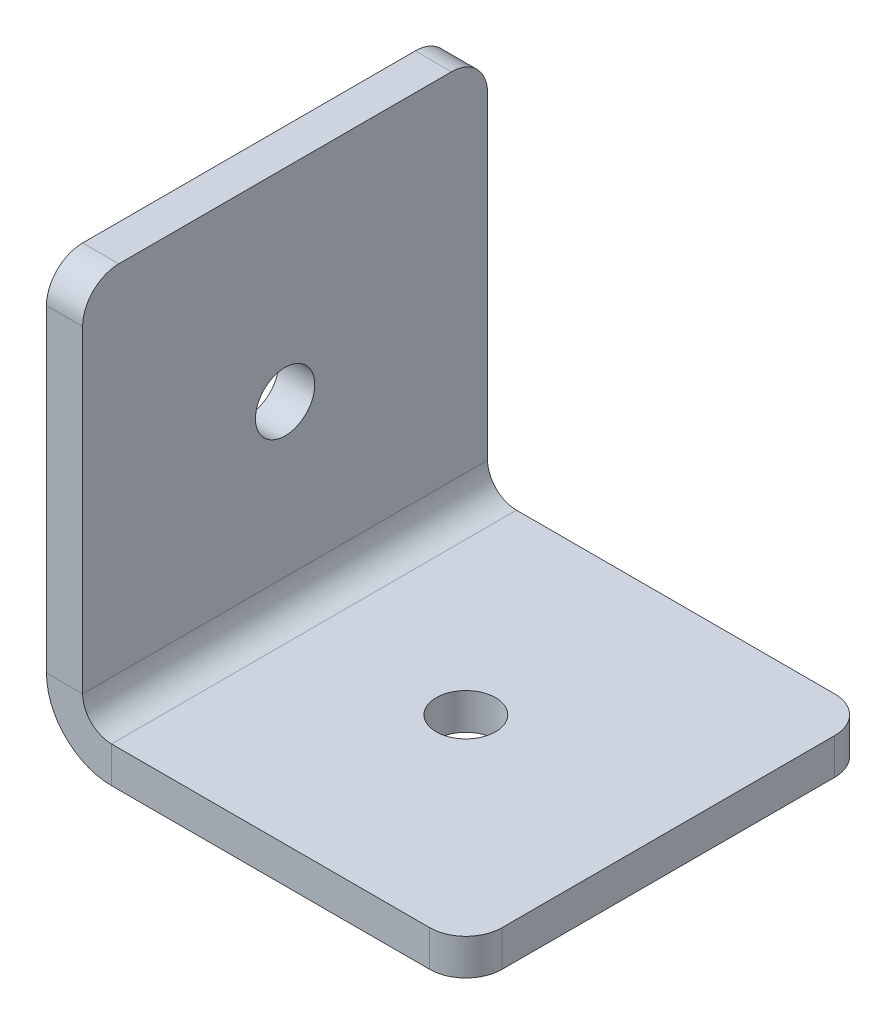
ISO-10303-21;
HEADER;
FILE_DESCRIPTION(('STEP AP214'),'2;1');
FILE_NAME('part.step','',(''),(''),'','','');
FILE_SCHEMA(('AUTOMOTIVE_DESIGN { 1 0 10303 214 1 1 1 1 }'));
ENDSEC;
DATA;
#1=APPLICATION_CONTEXT('core data for automotive mechanical design processes');
#2=APPLICATION_PROTOCOL_DEFINITION('international standard','automotive_design',2000,#1);
#3=PRODUCT_CONTEXT('',#1,'mechanical');
#4=PRODUCT('Part','Part','',(#3));
#5=PRODUCT_RELATED_PRODUCT_CATEGORY('part','',(#4));
#6=PRODUCT_DEFINITION_FORMATION('','',#4);
#7=PRODUCT_DEFINITION_CONTEXT('part definition',#1,'design');
#8=PRODUCT_DEFINITION('design','',#6,#7);
#9=PRODUCT_DEFINITION_SHAPE('','',#8);
#10=(LENGTH_UNIT() NAMED_UNIT(*) SI_UNIT(.MILLI.,.METRE.));
#11=(NAMED_UNIT(*) PLANE_ANGLE_UNIT() SI_UNIT($,.RADIAN.));
#12=(NAMED_UNIT(*) SI_UNIT($,.STERADIAN.) SOLID_ANGLE_UNIT());
#13=UNCERTAINTY_MEASURE_WITH_UNIT(LENGTH_MEASURE(1.E-05),#10,'distance_accuracy_value','');
#14=(GEOMETRIC_REPRESENTATION_CONTEXT(3) GLOBAL_UNCERTAINTY_ASSIGNED_CONTEXT((#13)) GLOBAL_UNIT_ASSIGNED_CONTEXT((#10,
#11,#12)) REPRESENTATION_CONTEXT('',''));
#15=CARTESIAN_POINT('',(0.,0.,0.));
#16=DIRECTION('',(0.,0.,1.));
#17=DIRECTION('',(1.,0.,0.));
#18=AXIS2_PLACEMENT_3D('',#15,#16,#17);
#19=CARTESIAN_POINT('',(5.,0.,0.));
#20=DIRECTION('',(0.,0.,-1.));
#21=DIRECTION('',(0.,1.,0.));
#22=AXIS2_PLACEMENT_3D('',#19,#20,#21);
#23=PLANE('',#22);
#24=DIRECTION('',(0.,1.,0.));
#25=VECTOR('',#24,1.);
#26=CARTESIAN_POINT('',(0.,0.,0.));
#27=LINE('',#26,#25);
#28=CARTESIAN_POINT('',(0.,53.,0.));
#29=VERTEX_POINT('',#28);
#30=CARTESIAN_POINT('',(0.,9.,0.));
#31=VERTEX_POINT('',#30);
#32=EDGE_CURVE('E178',#29,#31,#27,.F.);
#33=ORIENTED_EDGE('',*,*,#32,.F.);
#34=DIRECTION('',(-1.,0.,0.));
#35=VECTOR('',#34,1.);
#36=CARTESIAN_POINT('',(5.,53.,0.));
#37=LINE('',#36,#35);
#38=CARTESIAN_POINT('',(5.,53.,0.));
#39=VERTEX_POINT('',#38);
#40=EDGE_CURVE('E113',#29,#39,#37,.F.);
#41=ORIENTED_EDGE('',*,*,#40,.T.);
#42=DIRECTION('',(0.,1.,0.));
#43=VECTOR('',#42,1.);
#44=CARTESIAN_POINT('',(5.,0.,0.));
#45=LINE('',#44,#43);
#46=CARTESIAN_POINT('',(5.,9.,0.));
#47=VERTEX_POINT('',#46);
#48=EDGE_CURVE('E107',#39,#47,#45,.F.);
#49=ORIENTED_EDGE('',*,*,#48,.T.);
#50=DIRECTION('',(1.,0.,0.));
#51=VECTOR('',#50,1.);
#52=CARTESIAN_POINT('',(5.,9.,0.));
#53=LINE('',#52,#51);
#54=EDGE_CURVE('E110',#31,#47,#53,.T.);
#55=ORIENTED_EDGE('',*,*,#54,.F.);
#56=EDGE_LOOP('',(#33,#41,#49,#55));
#57=FACE_BOUND('',#56,.T.);
#58=ADVANCED_FACE('F16',(#57),#23,.T.);
#59=CARTESIAN_POINT('',(5.,58.,56.));
#60=DIRECTION('',(0.,-1.,0.));
#61=DIRECTION('',(0.,0.,-1.));
#62=AXIS2_PLACEMENT_3D('',#59,#60,#61);
#63=PLANE('',#62);
#64=DIRECTION('',(0.,0.,-1.));
#65=VECTOR('',#64,1.);
#66=CARTESIAN_POINT('',(5.,58.,56.));
#67=LINE('',#66,#65);
#68=CARTESIAN_POINT('',(5.,58.,51.));
#69=VERTEX_POINT('',#68);
#70=CARTESIAN_POINT('',(5.,58.,5.));
#71=VERTEX_POINT('',#70);
#72=EDGE_CURVE('E116',#69,#71,#67,.T.);
#73=ORIENTED_EDGE('',*,*,#72,.T.);
#74=DIRECTION('',(1.,0.,0.));
#75=VECTOR('',#74,1.);
#76=CARTESIAN_POINT('',(5.,58.,5.));
#77=LINE('',#76,#75);
#78=CARTESIAN_POINT('',(0.,58.,5.));
#79=VERTEX_POINT('',#78);
#80=EDGE_CURVE('E37',#71,#79,#77,.F.);
#81=ORIENTED_EDGE('',*,*,#80,.T.);
#82=DIRECTION('',(0.,0.,-1.));
#83=VECTOR('',#82,1.);
#84=CARTESIAN_POINT('',(0.,58.,56.));
#85=LINE('',#84,#83);
#86=CARTESIAN_POINT('',(0.,58.,51.));
#87=VERTEX_POINT('',#86);
#88=EDGE_CURVE('E176',#87,#79,#85,.T.);
#89=ORIENTED_EDGE('',*,*,#88,.F.);
#90=DIRECTION('',(-1.,0.,0.));
#91=VECTOR('',#90,1.);
#92=CARTESIAN_POINT('',(5.,58.,51.));
#93=LINE('',#92,#91);
#94=EDGE_CURVE('E209',#87,#69,#93,.F.);
#95=ORIENTED_EDGE('',*,*,#94,.T.);
#96=EDGE_LOOP('',(#73,#81,#89,#95));
#97=FACE_BOUND('',#96,.T.);
#98=ADVANCED_FACE('F221',(#97),#63,.F.);
#99=CARTESIAN_POINT('',(5.,0.,56.));
#100=DIRECTION('',(0.,0.,-1.));
#101=DIRECTION('',(0.,1.,0.));
#102=AXIS2_PLACEMENT_3D('',#99,#100,#101);
#103=PLANE('',#102);
#104=DIRECTION('',(0.,1.,0.));
#105=VECTOR('',#104,1.);
#106=CARTESIAN_POINT('',(5.,0.,56.));
#107=LINE('',#106,#105);
#108=CARTESIAN_POINT('',(5.,53.,56.));
#109=VERTEX_POINT('',#108);
#110=CARTESIAN_POINT('',(5.,9.,56.));
#111=VERTEX_POINT('',#110);
#112=EDGE_CURVE('E142',#109,#111,#107,.F.);
#113=ORIENTED_EDGE('',*,*,#112,.F.);
#114=DIRECTION('',(-1.,0.,0.));
#115=VECTOR('',#114,1.);
#116=CARTESIAN_POINT('',(5.,53.,56.));
#117=LINE('',#116,#115);
#118=CARTESIAN_POINT('',(0.,53.,56.));
#119=VERTEX_POINT('',#118);
#120=EDGE_CURVE('E10',#109,#119,#117,.T.);
#121=ORIENTED_EDGE('',*,*,#120,.T.);
#122=DIRECTION('',(0.,1.,0.));
#123=VECTOR('',#122,1.);
#124=CARTESIAN_POINT('',(0.,0.,56.));
#125=LINE('',#124,#123);
#126=CARTESIAN_POINT('',(0.,9.,56.));
#127=VERTEX_POINT('',#126);
#128=EDGE_CURVE('E163',#119,#127,#125,.F.);
#129=ORIENTED_EDGE('',*,*,#128,.T.);
#130=DIRECTION('',(1.,0.,0.));
#131=VECTOR('',#130,1.);
#132=CARTESIAN_POINT('',(5.,9.,56.));
#133=LINE('',#132,#131);
#134=EDGE_CURVE('E129',#127,#111,#133,.T.);
#135=ORIENTED_EDGE('',*,*,#134,.T.);
#136=EDGE_LOOP('',(#113,#121,#129,#135));
#137=FACE_BOUND('',#136,.T.);
#138=ADVANCED_FACE('F266',(#137),#103,.F.);
#139=CARTESIAN_POINT('',(9.,9.,56.));
#140=DIRECTION('',(0.,0.,-1.));
#141=DIRECTION('',(-1.,0.,0.));
#142=AXIS2_PLACEMENT_3D('',#139,#140,#141);
#143=PLANE('',#142);
#144=ORIENTED_EDGE('',*,*,#134,.F.);
#145=CARTESIAN_POINT('',(9.,9.,56.));
#146=DIRECTION('',(0.,0.,1.));
#147=DIRECTION('',(1.,0.,0.));
#148=AXIS2_PLACEMENT_3D('',#145,#146,#147);
#149=CIRCLE('',#148,9.);
#150=CARTESIAN_POINT('',(9.,0.,56.));
#151=VERTEX_POINT('',#150);
#152=EDGE_CURVE('E171',#127,#151,#149,.T.);
#153=ORIENTED_EDGE('',*,*,#152,.T.);
#154=DIRECTION('',(0.,1.,0.));
#155=VECTOR('',#154,1.);
#156=CARTESIAN_POINT('',(9.,5.,56.));
#157=LINE('',#156,#155);
#158=CARTESIAN_POINT('',(9.,5.,56.));
#159=VERTEX_POINT('',#158);
#160=EDGE_CURVE('E183',#151,#159,#157,.T.);
#161=ORIENTED_EDGE('',*,*,#160,.T.);
#162=CARTESIAN_POINT('',(9.,9.,56.));
#163=DIRECTION('',(0.,0.,1.));
#164=DIRECTION('',(1.,0.,0.));
#165=AXIS2_PLACEMENT_3D('',#162,#163,#164);
#166=CIRCLE('',#165,4.);
#167=EDGE_CURVE('E138',#111,#159,#166,.T.);
#168=ORIENTED_EDGE('',*,*,#167,.F.);
#169=EDGE_LOOP('',(#144,#153,#161,#168));
#170=FACE_BOUND('',#169,.T.);
#171=ADVANCED_FACE('F269',(#170),#143,.F.);
#172=CARTESIAN_POINT('',(0.,5.,56.));
#173=DIRECTION('',(0.,0.,1.));
#174=DIRECTION('',(1.,0.,0.));
#175=AXIS2_PLACEMENT_3D('',#172,#173,#174);
#176=PLANE('',#175);
#177=DIRECTION('',(1.,0.,0.));
#178=VECTOR('',#177,1.);
#179=CARTESIAN_POINT('',(0.,0.,56.));
#180=LINE('',#179,#178);
#181=CARTESIAN_POINT('',(53.,0.,56.));
#182=VERTEX_POINT('',#181);
#183=EDGE_CURVE('E166',#151,#182,#180,.T.);
#184=ORIENTED_EDGE('',*,*,#183,.T.);
#185=DIRECTION('',(0.,1.,0.));
#186=VECTOR('',#185,1.);
#187=CARTESIAN_POINT('',(53.,5.,56.));
#188=LINE('',#187,#186);
#189=CARTESIAN_POINT('',(53.,5.,56.));
#190=VERTEX_POINT('',#189);
#191=EDGE_CURVE('E128',#182,#190,#188,.T.);
#192=ORIENTED_EDGE('',*,*,#191,.T.);
#193=DIRECTION('',(1.,0.,0.));
#194=VECTOR('',#193,1.);
#195=CARTESIAN_POINT('',(0.,5.,56.));
#196=LINE('',#195,#194);
#197=EDGE_CURVE('E149',#159,#190,#196,.T.);
#198=ORIENTED_EDGE('',*,*,#197,.F.);
#199=ORIENTED_EDGE('',*,*,#160,.F.);
#200=EDGE_LOOP('',(#184,#192,#198,#199));
#201=FACE_BOUND('',#200,.T.);
#202=ADVANCED_FACE('F239',(#201),#176,.T.);
#203=CARTESIAN_POINT('',(58.,5.,56.));
#204=DIRECTION('',(1.,0.,0.));
#205=DIRECTION('',(0.,0.,-1.));
#206=AXIS2_PLACEMENT_3D('',#203,#204,#205);
#207=PLANE('',#206);
#208=DIRECTION('',(0.,0.,-1.));
#209=VECTOR('',#208,1.);
#210=CARTESIAN_POINT('',(58.,5.,56.));
#211=LINE('',#210,#209);
#212=CARTESIAN_POINT('',(58.,5.,51.));
#213=VERTEX_POINT('',#212);
#214=CARTESIAN_POINT('',(58.,5.,5.));
#215=VERTEX_POINT('',#214);
#216=EDGE_CURVE('E144',#213,#215,#211,.T.);
#217=ORIENTED_EDGE('',*,*,#216,.F.);
#218=DIRECTION('',(0.,1.,0.));
#219=VECTOR('',#218,1.);
#220=CARTESIAN_POINT('',(58.,5.,51.));
#221=LINE('',#220,#219);
#222=CARTESIAN_POINT('',(58.,0.,51.));
#223=VERTEX_POINT('',#222);
#224=EDGE_CURVE('E196',#213,#223,#221,.F.);
#225=ORIENTED_EDGE('',*,*,#224,.T.);
#226=DIRECTION('',(0.,0.,1.));
#227=VECTOR('',#226,1.);
#228=CARTESIAN_POINT('',(58.,0.,56.));
#229=LINE('',#228,#227);
#230=CARTESIAN_POINT('',(58.,0.,5.));
#231=VERTEX_POINT('',#230);
#232=EDGE_CURVE('E158',#223,#231,#229,.F.);
#233=ORIENTED_EDGE('',*,*,#232,.T.);
#234=DIRECTION('',(0.,-1.,0.));
#235=VECTOR('',#234,1.);
#236=CARTESIAN_POINT('',(58.,5.,5.));
#237=LINE('',#236,#235);
#238=EDGE_CURVE('E193',#231,#215,#237,.F.);
#239=ORIENTED_EDGE('',*,*,#238,.T.);
#240=EDGE_LOOP('',(#217,#225,#233,#239));
#241=FACE_BOUND('',#240,.T.);
#242=ADVANCED_FACE('F248',(#241),#207,.T.);
#243=CARTESIAN_POINT('',(0.,5.,0.));
#244=DIRECTION('',(0.,0.,1.));
#245=DIRECTION('',(1.,0.,0.));
#246=AXIS2_PLACEMENT_3D('',#243,#244,#245);
#247=PLANE('',#246);
#248=DIRECTION('',(1.,0.,0.));
#249=VECTOR('',#248,1.);
#250=CARTESIAN_POINT('',(0.,5.,0.));
#251=LINE('',#250,#249);
#252=CARTESIAN_POINT('',(9.,5.,0.));
#253=VERTEX_POINT('',#252);
#254=CARTESIAN_POINT('',(53.,5.,0.));
#255=VERTEX_POINT('',#254);
#256=EDGE_CURVE('E230',#253,#255,#251,.T.);
#257=ORIENTED_EDGE('',*,*,#256,.T.);
#258=DIRECTION('',(0.,1.,0.));
#259=VECTOR('',#258,1.);
#260=CARTESIAN_POINT('',(53.,5.,0.));
#261=LINE('',#260,#259);
#262=CARTESIAN_POINT('',(53.,0.,0.));
#263=VERTEX_POINT('',#262);
#264=EDGE_CURVE('E202',#255,#263,#261,.F.);
#265=ORIENTED_EDGE('',*,*,#264,.T.);
#266=DIRECTION('',(1.,0.,0.));
#267=VECTOR('',#266,1.);
#268=CARTESIAN_POINT('',(0.,0.,0.));
#269=LINE('',#268,#267);
#270=CARTESIAN_POINT('',(9.,0.,0.));
#271=VERTEX_POINT('',#270);
#272=EDGE_CURVE('E162',#271,#263,#269,.T.);
#273=ORIENTED_EDGE('',*,*,#272,.F.);
#274=DIRECTION('',(0.,1.,0.));
#275=VECTOR('',#274,1.);
#276=CARTESIAN_POINT('',(9.,5.,0.));
#277=LINE('',#276,#275);
#278=EDGE_CURVE('E146',#271,#253,#277,.T.);
#279=ORIENTED_EDGE('',*,*,#278,.T.);
#280=EDGE_LOOP('',(#257,#265,#273,#279));
#281=FACE_BOUND('',#280,.T.);
#282=ADVANCED_FACE('F259',(#281),#247,.F.);
#283=CARTESIAN_POINT('',(5.00000000000001,30.,28.));
#284=DIRECTION('',(1.,0.,0.));
#285=DIRECTION('',(0.,0.,-1.));
#286=AXIS2_PLACEMENT_3D('',#283,#284,#285);
#287=CYLINDRICAL_SURFACE('',#286,4.1);
#288=CARTESIAN_POINT('',(5.00000000000001,30.,28.));
#289=DIRECTION('',(-1.,0.,0.));
#290=DIRECTION('',(0.,0.,1.));
#291=AXIS2_PLACEMENT_3D('',#288,#289,#290);
#292=CIRCLE('',#291,4.1);
#293=CARTESIAN_POINT('',(5.00000000000001,30.,32.1));
#294=VERTEX_POINT('',#293);
#295=EDGE_CURVE('E117',#294,#294,#292,.T.);
#296=ORIENTED_EDGE('',*,*,#295,.F.);
#297=EDGE_LOOP('',(#296));
#298=FACE_BOUND('',#297,.T.);
#299=CARTESIAN_POINT('',(0.,30.,28.));
#300=DIRECTION('',(-1.,0.,0.));
#301=DIRECTION('',(0.,-1.,0.));
#302=AXIS2_PLACEMENT_3D('',#299,#300,#301);
#303=CIRCLE('',#302,4.1);
#304=CARTESIAN_POINT('',(0.,25.9,28.));
#305=VERTEX_POINT('',#304);
#306=EDGE_CURVE('E174',#305,#305,#303,.T.);
#307=ORIENTED_EDGE('',*,*,#306,.T.);
#308=EDGE_LOOP('',(#307));
#309=FACE_BOUND('',#308,.T.);
#310=ADVANCED_FACE('F289',(#298,#309),#287,.F.);
#311=CARTESIAN_POINT('',(30.,5.,28.));
#312=DIRECTION('',(0.,1.,0.));
#313=DIRECTION('',(0.,0.,1.));
#314=AXIS2_PLACEMENT_3D('',#311,#312,#313);
#315=CYLINDRICAL_SURFACE('',#314,4.1);
#316=CARTESIAN_POINT('',(30.,5.,28.));
#317=DIRECTION('',(0.,1.,0.));
#318=DIRECTION('',(0.,0.,1.));
#319=AXIS2_PLACEMENT_3D('',#316,#317,#318);
#320=CIRCLE('',#319,4.1);
#321=CARTESIAN_POINT('',(30.,5.,32.1));
#322=VERTEX_POINT('',#321);
#323=EDGE_CURVE('E224',#322,#322,#320,.T.);
#324=ORIENTED_EDGE('',*,*,#323,.T.);
#325=EDGE_LOOP('',(#324));
#326=FACE_BOUND('',#325,.T.);
#327=CARTESIAN_POINT('',(30.,0.,28.));
#328=DIRECTION('',(0.,1.,0.));
#329=DIRECTION('',(0.,0.,1.));
#330=AXIS2_PLACEMENT_3D('',#327,#328,#329);
#331=CIRCLE('',#330,4.1);
#332=CARTESIAN_POINT('',(30.,0.,32.1));
#333=VERTEX_POINT('',#332);
#334=EDGE_CURVE('E159',#333,#333,#331,.T.);
#335=ORIENTED_EDGE('',*,*,#334,.F.);
#336=EDGE_LOOP('',(#335));
#337=FACE_BOUND('',#336,.T.);
#338=ADVANCED_FACE('F288',(#326,#337),#315,.F.);
#339=CARTESIAN_POINT('',(9.,9.,0.));
#340=DIRECTION('',(0.,0.,1.));
#341=DIRECTION('',(1.,0.,0.));
#342=AXIS2_PLACEMENT_3D('',#339,#340,#341);
#343=PLANE('',#342);
#344=CARTESIAN_POINT('',(9.,9.,0.));
#345=DIRECTION('',(0.,0.,1.));
#346=DIRECTION('',(1.,0.,0.));
#347=AXIS2_PLACEMENT_3D('',#344,#345,#346);
#348=CIRCLE('',#347,9.);
#349=EDGE_CURVE('E127',#271,#31,#348,.F.);
#350=ORIENTED_EDGE('',*,*,#349,.T.);
#351=ORIENTED_EDGE('',*,*,#54,.T.);
#352=CARTESIAN_POINT('',(9.,9.,0.));
#353=DIRECTION('',(0.,0.,-1.));
#354=DIRECTION('',(-1.,0.,0.));
#355=AXIS2_PLACEMENT_3D('',#352,#353,#354);
#356=CIRCLE('',#355,4.);
#357=EDGE_CURVE('E124',#253,#47,#356,.T.);
#358=ORIENTED_EDGE('',*,*,#357,.F.);
#359=ORIENTED_EDGE('',*,*,#278,.F.);
#360=EDGE_LOOP('',(#350,#351,#358,#359));
#361=FACE_BOUND('',#360,.T.);
#362=ADVANCED_FACE('F123',(#361),#343,.F.);
#363=CARTESIAN_POINT('',(0.,5.,56.));
#364=DIRECTION('',(0.,1.,0.));
#365=DIRECTION('',(0.,0.,1.));
#366=AXIS2_PLACEMENT_3D('',#363,#364,#365);
#367=PLANE('',#366);
#368=ORIENTED_EDGE('',*,*,#323,.F.);
#369=EDGE_LOOP('',(#368));
#370=FACE_BOUND('',#369,.T.);
#371=ORIENTED_EDGE('',*,*,#197,.T.);
#372=CARTESIAN_POINT('',(53.,5.,51.));
#373=DIRECTION('',(0.,1.,0.));
#374=DIRECTION('',(0.,0.,1.));
#375=AXIS2_PLACEMENT_3D('',#372,#373,#374);
#376=CIRCLE('',#375,5.);
#377=EDGE_CURVE('E191',#190,#213,#376,.T.);
#378=ORIENTED_EDGE('',*,*,#377,.T.);
#379=ORIENTED_EDGE('',*,*,#216,.T.);
#380=CARTESIAN_POINT('',(53.,5.,5.));
#381=DIRECTION('',(0.,1.,0.));
#382=DIRECTION('',(0.,0.,1.));
#383=AXIS2_PLACEMENT_3D('',#380,#381,#382);
#384=CIRCLE('',#383,5.);
#385=EDGE_CURVE('E189',#215,#255,#384,.T.);
#386=ORIENTED_EDGE('',*,*,#385,.T.);
#387=ORIENTED_EDGE('',*,*,#256,.F.);
#388=DIRECTION('',(0.,0.,-1.));
#389=VECTOR('',#388,1.);
#390=CARTESIAN_POINT('',(9.,5.,56.));
#391=LINE('',#390,#389);
#392=EDGE_CURVE('E137',#253,#159,#391,.F.);
#393=ORIENTED_EDGE('',*,*,#392,.T.);
#394=EDGE_LOOP('',(#371,#378,#379,#386,#387,#393));
#395=FACE_BOUND('',#394,.T.);
#396=ADVANCED_FACE('F235',(#370,#395),#367,.T.);
#397=CARTESIAN_POINT('',(5.,0.,56.));
#398=DIRECTION('',(1.,0.,0.));
#399=DIRECTION('',(0.,0.,-1.));
#400=AXIS2_PLACEMENT_3D('',#397,#398,#399);
#401=PLANE('',#400);
#402=ORIENTED_EDGE('',*,*,#295,.T.);
#403=EDGE_LOOP('',(#402));
#404=FACE_BOUND('',#403,.T.);
#405=ORIENTED_EDGE('',*,*,#48,.F.);
#406=CARTESIAN_POINT('',(5.,53.,5.));
#407=DIRECTION('',(1.,0.,0.));
#408=DIRECTION('',(0.,0.,-1.));
#409=AXIS2_PLACEMENT_3D('',#406,#407,#408);
#410=CIRCLE('',#409,5.);
#411=EDGE_CURVE('E207',#39,#71,#410,.T.);
#412=ORIENTED_EDGE('',*,*,#411,.T.);
#413=ORIENTED_EDGE('',*,*,#72,.F.);
#414=CARTESIAN_POINT('',(5.,53.,51.));
#415=DIRECTION('',(1.,0.,0.));
#416=DIRECTION('',(0.,0.,-1.));
#417=AXIS2_PLACEMENT_3D('',#414,#415,#416);
#418=CIRCLE('',#417,5.);
#419=EDGE_CURVE('E205',#69,#109,#418,.T.);
#420=ORIENTED_EDGE('',*,*,#419,.T.);
#421=ORIENTED_EDGE('',*,*,#112,.T.);
#422=DIRECTION('',(0.,0.,-1.));
#423=VECTOR('',#422,1.);
#424=CARTESIAN_POINT('',(5.,9.,0.));
#425=LINE('',#424,#423);
#426=EDGE_CURVE('E135',#111,#47,#425,.T.);
#427=ORIENTED_EDGE('',*,*,#426,.T.);
#428=EDGE_LOOP('',(#405,#412,#413,#420,#421,#427));
#429=FACE_BOUND('',#428,.T.);
#430=ADVANCED_FACE('F141',(#404,#429),#401,.T.);
#431=CARTESIAN_POINT('',(9.,9.,56.));
#432=DIRECTION('',(0.,0.,1.));
#433=DIRECTION('',(1.,0.,0.));
#434=AXIS2_PLACEMENT_3D('',#431,#432,#433);
#435=CYLINDRICAL_SURFACE('',#434,4.);
#436=ORIENTED_EDGE('',*,*,#167,.T.);
#437=ORIENTED_EDGE('',*,*,#392,.F.);
#438=ORIENTED_EDGE('',*,*,#357,.T.);
#439=ORIENTED_EDGE('',*,*,#426,.F.);
#440=EDGE_LOOP('',(#436,#437,#438,#439));
#441=FACE_BOUND('',#440,.T.);
#442=ADVANCED_FACE('F134',(#441),#435,.F.);
#443=CARTESIAN_POINT('',(0.,0.,56.));
#444=DIRECTION('',(0.,1.,0.));
#445=DIRECTION('',(0.,0.,1.));
#446=AXIS2_PLACEMENT_3D('',#443,#444,#445);
#447=PLANE('',#446);
#448=ORIENTED_EDGE('',*,*,#334,.T.);
#449=EDGE_LOOP('',(#448));
#450=FACE_BOUND('',#449,.T.);
#451=ORIENTED_EDGE('',*,*,#232,.F.);
#452=CARTESIAN_POINT('',(53.,0.,51.));
#453=DIRECTION('',(0.,1.,0.));
#454=DIRECTION('',(0.,0.,1.));
#455=AXIS2_PLACEMENT_3D('',#452,#453,#454);
#456=CIRCLE('',#455,5.);
#457=EDGE_CURVE('E200',#223,#182,#456,.F.);
#458=ORIENTED_EDGE('',*,*,#457,.T.);
#459=ORIENTED_EDGE('',*,*,#183,.F.);
#460=DIRECTION('',(0.,0.,1.));
#461=VECTOR('',#460,1.);
#462=CARTESIAN_POINT('',(9.,0.,56.));
#463=LINE('',#462,#461);
#464=EDGE_CURVE('E139',#271,#151,#463,.T.);
#465=ORIENTED_EDGE('',*,*,#464,.F.);
#466=ORIENTED_EDGE('',*,*,#272,.T.);
#467=CARTESIAN_POINT('',(53.,0.,5.));
#468=DIRECTION('',(0.,1.,0.));
#469=DIRECTION('',(0.,0.,1.));
#470=AXIS2_PLACEMENT_3D('',#467,#468,#469);
#471=CIRCLE('',#470,5.);
#472=EDGE_CURVE('E198',#263,#231,#471,.F.);
#473=ORIENTED_EDGE('',*,*,#472,.T.);
#474=EDGE_LOOP('',(#451,#458,#459,#465,#466,#473));
#475=FACE_BOUND('',#474,.T.);
#476=ADVANCED_FACE('F251',(#450,#475),#447,.F.);
#477=CARTESIAN_POINT('',(0.,0.,56.));
#478=DIRECTION('',(1.,0.,0.));
#479=DIRECTION('',(0.,0.,-1.));
#480=AXIS2_PLACEMENT_3D('',#477,#478,#479);
#481=PLANE('',#480);
#482=ORIENTED_EDGE('',*,*,#306,.F.);
#483=EDGE_LOOP('',(#482));
#484=FACE_BOUND('',#483,.T.);
#485=ORIENTED_EDGE('',*,*,#88,.T.);
#486=CARTESIAN_POINT('',(0.,53.,5.));
#487=DIRECTION('',(1.,0.,0.));
#488=DIRECTION('',(0.,0.,-1.));
#489=AXIS2_PLACEMENT_3D('',#486,#487,#488);
#490=CIRCLE('',#489,5.);
#491=EDGE_CURVE('E24',#79,#29,#490,.F.);
#492=ORIENTED_EDGE('',*,*,#491,.T.);
#493=ORIENTED_EDGE('',*,*,#32,.T.);
#494=DIRECTION('',(0.,0.,-1.));
#495=VECTOR('',#494,1.);
#496=CARTESIAN_POINT('',(0.,9.,56.));
#497=LINE('',#496,#495);
#498=EDGE_CURVE('E156',#127,#31,#497,.T.);
#499=ORIENTED_EDGE('',*,*,#498,.F.);
#500=ORIENTED_EDGE('',*,*,#128,.F.);
#501=CARTESIAN_POINT('',(0.,53.,51.));
#502=DIRECTION('',(1.,0.,0.));
#503=DIRECTION('',(0.,0.,-1.));
#504=AXIS2_PLACEMENT_3D('',#501,#502,#503);
#505=CIRCLE('',#504,5.);
#506=EDGE_CURVE('E213',#119,#87,#505,.F.);
#507=ORIENTED_EDGE('',*,*,#506,.T.);
#508=EDGE_LOOP('',(#485,#492,#493,#499,#500,#507));
#509=FACE_BOUND('',#508,.T.);
#510=ADVANCED_FACE('F216',(#484,#509),#481,.F.);
#511=CARTESIAN_POINT('',(9.,9.,56.));
#512=DIRECTION('',(0.,0.,1.));
#513=DIRECTION('',(1.,0.,0.));
#514=AXIS2_PLACEMENT_3D('',#511,#512,#513);
#515=CYLINDRICAL_SURFACE('',#514,9.);
#516=ORIENTED_EDGE('',*,*,#152,.F.);
#517=ORIENTED_EDGE('',*,*,#498,.T.);
#518=ORIENTED_EDGE('',*,*,#349,.F.);
#519=ORIENTED_EDGE('',*,*,#464,.T.);
#520=EDGE_LOOP('',(#516,#517,#518,#519));
#521=FACE_BOUND('',#520,.T.);
#522=ADVANCED_FACE('F262',(#521),#515,.T.);
#523=CARTESIAN_POINT('',(53.,5.,51.));
#524=DIRECTION('',(0.,1.,0.));
#525=DIRECTION('',(0.,0.,1.));
#526=AXIS2_PLACEMENT_3D('',#523,#524,#525);
#527=CYLINDRICAL_SURFACE('',#526,5.);
#528=ORIENTED_EDGE('',*,*,#457,.F.);
#529=ORIENTED_EDGE('',*,*,#224,.F.);
#530=ORIENTED_EDGE('',*,*,#377,.F.);
#531=ORIENTED_EDGE('',*,*,#191,.F.);
#532=EDGE_LOOP('',(#528,#529,#530,#531));
#533=FACE_BOUND('',#532,.T.);
#534=ADVANCED_FACE('F244',(#533),#527,.T.);
#535=CARTESIAN_POINT('',(53.,5.,5.));
#536=DIRECTION('',(0.,-1.,0.));
#537=DIRECTION('',(0.,0.,-1.));
#538=AXIS2_PLACEMENT_3D('',#535,#536,#537);
#539=CYLINDRICAL_SURFACE('',#538,5.);
#540=ORIENTED_EDGE('',*,*,#472,.F.);
#541=ORIENTED_EDGE('',*,*,#264,.F.);
#542=ORIENTED_EDGE('',*,*,#385,.F.);
#543=ORIENTED_EDGE('',*,*,#238,.F.);
#544=EDGE_LOOP('',(#540,#541,#542,#543));
#545=FACE_BOUND('',#544,.T.);
#546=ADVANCED_FACE('F257',(#545),#539,.T.);
#547=CARTESIAN_POINT('',(5.,53.,5.));
#548=DIRECTION('',(-1.,0.,0.));
#549=DIRECTION('',(0.,0.,1.));
#550=AXIS2_PLACEMENT_3D('',#547,#548,#549);
#551=CYLINDRICAL_SURFACE('',#550,5.);
#552=ORIENTED_EDGE('',*,*,#491,.F.);
#553=ORIENTED_EDGE('',*,*,#80,.F.);
#554=ORIENTED_EDGE('',*,*,#411,.F.);
#555=ORIENTED_EDGE('',*,*,#40,.F.);
#556=EDGE_LOOP('',(#552,#553,#554,#555));
#557=FACE_BOUND('',#556,.T.);
#558=ADVANCED_FACE('F219',(#557),#551,.T.);
#559=CARTESIAN_POINT('',(5.,53.,51.));
#560=DIRECTION('',(1.,0.,0.));
#561=DIRECTION('',(0.,0.,-1.));
#562=AXIS2_PLACEMENT_3D('',#559,#560,#561);
#563=CYLINDRICAL_SURFACE('',#562,5.);
#564=ORIENTED_EDGE('',*,*,#506,.F.);
#565=ORIENTED_EDGE('',*,*,#120,.F.);
#566=ORIENTED_EDGE('',*,*,#419,.F.);
#567=ORIENTED_EDGE('',*,*,#94,.F.);
#568=EDGE_LOOP('',(#564,#565,#566,#567));
#569=FACE_BOUND('',#568,.T.);
#570=ADVANCED_FACE('F18',(#569),#563,.T.);
#571=CLOSED_SHELL('',(#58,#98,#138,#171,#202,#242,#282,#310,#338,#362,#396,#430,#442,#476,#510,
#522,#534,#546,#558,#570));
#572=MANIFOLD_SOLID_BREP('B1',#571);
#573=ADVANCED_BREP_SHAPE_REPRESENTATION('',(#18,#572),#14);
#574=SHAPE_DEFINITION_REPRESENTATION(#9,#573);
ENDSEC;
END-ISO-10303-21;
